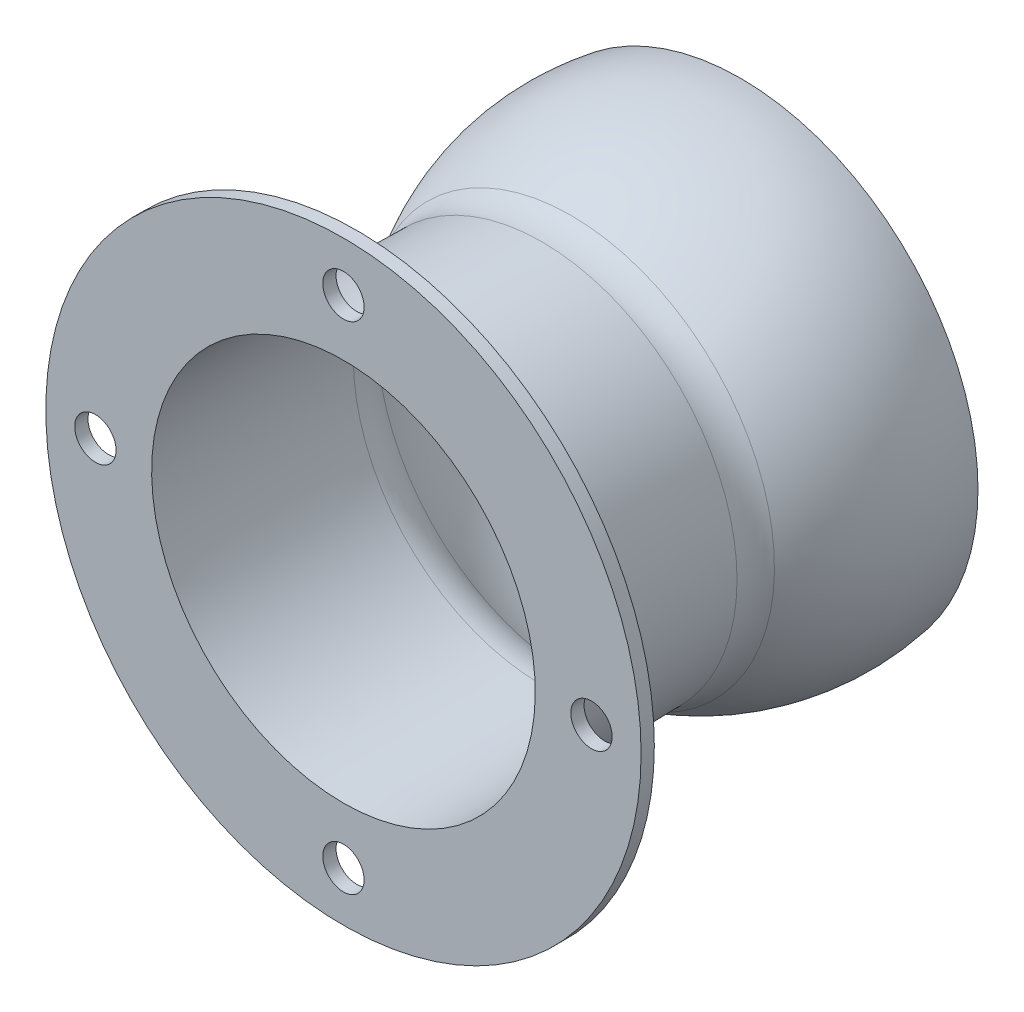
ISO-10303-21;
HEADER;
FILE_DESCRIPTION(('STEP AP214'),'2;1');
FILE_NAME('part.step','',(''),(''),'','','');
FILE_SCHEMA(('AUTOMOTIVE_DESIGN { 1 0 10303 214 1 1 1 1 }'));
ENDSEC;
DATA;
#1=APPLICATION_CONTEXT('core data for automotive mechanical design processes');
#2=APPLICATION_PROTOCOL_DEFINITION('international standard','automotive_design',2000,#1);
#3=PRODUCT_CONTEXT('',#1,'mechanical');
#4=PRODUCT('Part','Part','',(#3));
#5=PRODUCT_RELATED_PRODUCT_CATEGORY('part','',(#4));
#6=PRODUCT_DEFINITION_FORMATION('','',#4);
#7=PRODUCT_DEFINITION_CONTEXT('part definition',#1,'design');
#8=PRODUCT_DEFINITION('design','',#6,#7);
#9=PRODUCT_DEFINITION_SHAPE('','',#8);
#10=(LENGTH_UNIT() NAMED_UNIT(*) SI_UNIT(.MILLI.,.METRE.));
#11=(NAMED_UNIT(*) PLANE_ANGLE_UNIT() SI_UNIT($,.RADIAN.));
#12=(NAMED_UNIT(*) SI_UNIT($,.STERADIAN.) SOLID_ANGLE_UNIT());
#13=UNCERTAINTY_MEASURE_WITH_UNIT(LENGTH_MEASURE(1.E-05),#10,'distance_accuracy_value','');
#14=(GEOMETRIC_REPRESENTATION_CONTEXT(3) GLOBAL_UNCERTAINTY_ASSIGNED_CONTEXT((#13)) GLOBAL_UNIT_ASSIGNED_CONTEXT((#10,
#11,#12)) REPRESENTATION_CONTEXT('',''));
#15=CARTESIAN_POINT('',(0.,0.,0.));
#16=DIRECTION('',(0.,0.,1.));
#17=DIRECTION('',(1.,0.,0.));
#18=AXIS2_PLACEMENT_3D('',#15,#16,#17);
#19=CARTESIAN_POINT('',(0.,0.,30.0542550144842));
#20=DIRECTION('',(0.,0.,1.));
#21=DIRECTION('',(0.,-1.,0.));
#22=AXIS2_PLACEMENT_3D('',#19,#20,#21);
#23=CONICAL_SURFACE('',#22,29.5,0.0166651237139406);
#24=CARTESIAN_POINT('',(0.,0.,30.0542550144842));
#25=DIRECTION('',(0.,0.,-1.));
#26=DIRECTION('',(0.,1.,0.));
#27=AXIS2_PLACEMENT_3D('',#24,#25,#26);
#28=CIRCLE('',#27,29.5);
#29=CARTESIAN_POINT('',(0.,29.5,30.0542550144842));
#30=VERTEX_POINT('',#29);
#31=EDGE_CURVE('E45',#30,#30,#28,.T.);
#32=ORIENTED_EDGE('',*,*,#31,.F.);
#33=EDGE_LOOP('',(#32));
#34=FACE_BOUND('',#33,.T.);
#35=CARTESIAN_POINT('',(0.,0.,58.0542550144842));
#36=DIRECTION('',(0.,0.,1.));
#37=DIRECTION('',(1.,0.,0.));
#38=AXIS2_PLACEMENT_3D('',#35,#36,#37);
#39=CIRCLE('',#38,29.9666666666667);
#40=CARTESIAN_POINT('',(29.9666666666667,0.,58.0542550144842));
#41=VERTEX_POINT('',#40);
#42=EDGE_CURVE('E41',#41,#41,#39,.F.);
#43=ORIENTED_EDGE('',*,*,#42,.T.);
#44=EDGE_LOOP('',(#43));
#45=FACE_BOUND('',#44,.T.);
#46=ADVANCED_FACE('F37',(#34,#45),#23,.T.);
#47=CARTESIAN_POINT('',(0.,0.,6.14714548940946));
#48=DIRECTION('',(0.,0.,-1.));
#49=DIRECTION('',(0.,1.,0.));
#50=AXIS2_PLACEMENT_3D('',#47,#48,#49);
#51=SPHERICAL_SURFACE('',#50,36.4);
#52=CARTESIAN_POINT('',(0.,0.,25.637373582046));
#53=DIRECTION('',(0.,0.,-1.));
#54=DIRECTION('',(0.,1.,0.));
#55=AXIS2_PLACEMENT_3D('',#52,#53,#54);
#56=CIRCLE('',#55,30.7423325220615);
#57=CARTESIAN_POINT('',(0.,30.7423325220615,25.637373582046));
#58=VERTEX_POINT('',#57);
#59=EDGE_CURVE('E10',#58,#58,#56,.T.);
#60=ORIENTED_EDGE('',*,*,#59,.T.);
#61=EDGE_LOOP('',(#60));
#62=FACE_BOUND('',#61,.T.);
#63=CARTESIAN_POINT('',(0.,0.,0.));
#64=DIRECTION('',(0.,0.,-1.));
#65=DIRECTION('',(0.,1.,0.));
#66=AXIS2_PLACEMENT_3D('',#63,#64,#65);
#67=CIRCLE('',#66,35.8771877706717);
#68=CARTESIAN_POINT('',(0.,35.8771877706717,0.));
#69=VERTEX_POINT('',#68);
#70=EDGE_CURVE('E49',#69,#69,#67,.T.);
#71=ORIENTED_EDGE('',*,*,#70,.F.);
#72=EDGE_LOOP('',(#71));
#73=FACE_BOUND('',#72,.T.);
#74=ADVANCED_FACE('F39',(#62,#73),#51,.T.);
#75=CARTESIAN_POINT('',(0.,0.,29.9209401958123));
#76=DIRECTION('',(0.,0.,-1.));
#77=DIRECTION('',(0.,1.,0.));
#78=AXIS2_PLACEMENT_3D('',#75,#76,#77);
#79=TOROIDAL_SURFACE('',#78,37.4988891203168,8.00000000000001);
#80=ORIENTED_EDGE('',*,*,#31,.T.);
#81=EDGE_LOOP('',(#80));
#82=FACE_BOUND('',#81,.T.);
#83=ORIENTED_EDGE('',*,*,#59,.F.);
#84=EDGE_LOOP('',(#83));
#85=FACE_BOUND('',#84,.T.);
#86=ADVANCED_FACE('F111',(#82,#85),#79,.F.);
#87=CARTESIAN_POINT('',(0.,0.,60.0542550144842));
#88=DIRECTION('',(0.,0.,1.));
#89=DIRECTION('',(0.,-1.,0.));
#90=AXIS2_PLACEMENT_3D('',#87,#88,#89);
#91=PLANE('',#90);
#92=CARTESIAN_POINT('',(0.,0.,60.0542550144842));
#93=DIRECTION('',(0.,0.,1.));
#94=DIRECTION('',(0.,-1.,0.));
#95=AXIS2_PLACEMENT_3D('',#92,#93,#94);
#96=CIRCLE('',#95,28.9998611207548);
#97=CARTESIAN_POINT('',(0.,-28.9998611207548,60.0542550144842));
#98=VERTEX_POINT('',#97);
#99=EDGE_CURVE('E55',#98,#98,#96,.F.);
#100=ORIENTED_EDGE('',*,*,#99,.T.);
#101=EDGE_LOOP('',(#100));
#102=FACE_BOUND('',#101,.T.);
#103=CARTESIAN_POINT('',(-37.5,0.,60.0542550144842));
#104=DIRECTION('',(0.,0.,1.));
#105=DIRECTION('',(1.,0.,0.));
#106=AXIS2_PLACEMENT_3D('',#103,#104,#105);
#107=CIRCLE('',#106,3.125);
#108=CARTESIAN_POINT('',(-34.375,0.,60.0542550144842));
#109=VERTEX_POINT('',#108);
#110=EDGE_CURVE('E91',#109,#109,#107,.T.);
#111=ORIENTED_EDGE('',*,*,#110,.F.);
#112=EDGE_LOOP('',(#111));
#113=FACE_BOUND('',#112,.T.);
#114=CARTESIAN_POINT('',(0.,-37.5,60.0542550144842));
#115=DIRECTION('',(0.,0.,1.));
#116=DIRECTION('',(1.,0.,0.));
#117=AXIS2_PLACEMENT_3D('',#114,#115,#116);
#118=CIRCLE('',#117,3.125);
#119=CARTESIAN_POINT('',(3.12500000000001,-37.5,60.0542550144842));
#120=VERTEX_POINT('',#119);
#121=EDGE_CURVE('E85',#120,#120,#118,.T.);
#122=ORIENTED_EDGE('',*,*,#121,.F.);
#123=EDGE_LOOP('',(#122));
#124=FACE_BOUND('',#123,.T.);
#125=CARTESIAN_POINT('',(37.5,0.,60.0542550144842));
#126=DIRECTION('',(0.,0.,1.));
#127=DIRECTION('',(1.,0.,0.));
#128=AXIS2_PLACEMENT_3D('',#125,#126,#127);
#129=CIRCLE('',#128,3.12500000000012);
#130=CARTESIAN_POINT('',(40.6250000000001,0.,60.0542550144842));
#131=VERTEX_POINT('',#130);
#132=EDGE_CURVE('E79',#131,#131,#129,.T.);
#133=ORIENTED_EDGE('',*,*,#132,.F.);
#134=EDGE_LOOP('',(#133));
#135=FACE_BOUND('',#134,.T.);
#136=CARTESIAN_POINT('',(0.,37.5,60.0542550144842));
#137=DIRECTION('',(0.,0.,1.));
#138=DIRECTION('',(1.,0.,0.));
#139=AXIS2_PLACEMENT_3D('',#136,#137,#138);
#140=CIRCLE('',#139,3.125);
#141=CARTESIAN_POINT('',(3.125,37.5,60.0542550144842));
#142=VERTEX_POINT('',#141);
#143=EDGE_CURVE('E73',#142,#142,#140,.T.);
#144=ORIENTED_EDGE('',*,*,#143,.F.);
#145=EDGE_LOOP('',(#144));
#146=FACE_BOUND('',#145,.T.);
#147=CARTESIAN_POINT('',(0.,0.,60.0542550144842));
#148=DIRECTION('',(0.,0.,1.));
#149=DIRECTION('',(1.,0.,0.));
#150=AXIS2_PLACEMENT_3D('',#147,#148,#149);
#151=CIRCLE('',#150,45.);
#152=CARTESIAN_POINT('',(45.,0.,60.0542550144842));
#153=VERTEX_POINT('',#152);
#154=EDGE_CURVE('E66',#153,#153,#151,.T.);
#155=ORIENTED_EDGE('',*,*,#154,.T.);
#156=EDGE_LOOP('',(#155));
#157=FACE_BOUND('',#156,.T.);
#158=ADVANCED_FACE('F107',(#102,#113,#124,#135,#146,#157),#91,.T.);
#159=CARTESIAN_POINT('',(0.,0.,0.));
#160=DIRECTION('',(0.,0.,1.));
#161=DIRECTION('',(0.,-1.,0.));
#162=AXIS2_PLACEMENT_3D('',#159,#160,#161);
#163=PLANE('',#162);
#164=CARTESIAN_POINT('',(0.,0.,0.));
#165=DIRECTION('',(0.,0.,1.));
#166=DIRECTION('',(0.,-1.,0.));
#167=AXIS2_PLACEMENT_3D('',#164,#165,#166);
#168=CIRCLE('',#167,34.8621944566321);
#169=CARTESIAN_POINT('',(0.,-34.8621944566321,0.));
#170=VERTEX_POINT('',#169);
#171=EDGE_CURVE('E59',#170,#170,#168,.F.);
#172=ORIENTED_EDGE('',*,*,#171,.F.);
#173=EDGE_LOOP('',(#172));
#174=FACE_BOUND('',#173,.T.);
#175=ORIENTED_EDGE('',*,*,#70,.T.);
#176=EDGE_LOOP('',(#175));
#177=FACE_BOUND('',#176,.T.);
#178=ADVANCED_FACE('F110',(#174,#177),#163,.F.);
#179=CARTESIAN_POINT('',(0.,0.,6.14714548940946));
#180=DIRECTION('',(0.,0.,-1.));
#181=DIRECTION('',(0.,1.,0.));
#182=AXIS2_PLACEMENT_3D('',#179,#180,#181);
#183=SPHERICAL_SURFACE('',#182,35.4);
#184=CARTESIAN_POINT('',(0.,0.,25.1019277553252));
#185=DIRECTION('',(0.,0.,-1.));
#186=DIRECTION('',(0.,1.,0.));
#187=AXIS2_PLACEMENT_3D('',#184,#185,#186);
#188=CIRCLE('',#187,29.8977629472796);
#189=CARTESIAN_POINT('',(0.,29.8977629472796,25.1019277553252));
#190=VERTEX_POINT('',#189);
#191=EDGE_CURVE('E54',#190,#190,#188,.T.);
#192=ORIENTED_EDGE('',*,*,#191,.F.);
#193=EDGE_LOOP('',(#192));
#194=FACE_BOUND('',#193,.T.);
#195=ORIENTED_EDGE('',*,*,#171,.T.);
#196=EDGE_LOOP('',(#195));
#197=FACE_BOUND('',#196,.T.);
#198=ADVANCED_FACE('F164',(#194,#197),#183,.F.);
#199=CARTESIAN_POINT('',(0.,0.,29.9209401958123));
#200=DIRECTION('',(0.,0.,-1.));
#201=DIRECTION('',(0.,1.,0.));
#202=AXIS2_PLACEMENT_3D('',#199,#200,#201);
#203=TOROIDAL_SURFACE('',#202,37.4988891203168,9.00000000000001);
#204=CARTESIAN_POINT('',(0.,0.,30.0709193668182));
#205=DIRECTION('',(0.,0.,-1.));
#206=DIRECTION('',(0.,1.,0.));
#207=AXIS2_PLACEMENT_3D('',#204,#205,#206);
#208=CIRCLE('',#207,28.5001388599604);
#209=CARTESIAN_POINT('',(0.,28.5001388599604,30.0709193668182));
#210=VERTEX_POINT('',#209);
#211=EDGE_CURVE('E58',#210,#210,#208,.T.);
#212=ORIENTED_EDGE('',*,*,#211,.F.);
#213=EDGE_LOOP('',(#212));
#214=FACE_BOUND('',#213,.T.);
#215=ORIENTED_EDGE('',*,*,#191,.T.);
#216=EDGE_LOOP('',(#215));
#217=FACE_BOUND('',#216,.T.);
#218=ADVANCED_FACE('F134',(#214,#217),#203,.T.);
#219=CARTESIAN_POINT('',(0.,0.,30.0709193668182));
#220=DIRECTION('',(0.,0.,1.));
#221=DIRECTION('',(0.,-1.,0.));
#222=AXIS2_PLACEMENT_3D('',#219,#220,#221);
#223=CONICAL_SURFACE('',#222,28.5001388599604,0.0166651237139406);
#224=ORIENTED_EDGE('',*,*,#99,.F.);
#225=EDGE_LOOP('',(#224));
#226=FACE_BOUND('',#225,.T.);
#227=ORIENTED_EDGE('',*,*,#211,.T.);
#228=EDGE_LOOP('',(#227));
#229=FACE_BOUND('',#228,.T.);
#230=ADVANCED_FACE('F124',(#226,#229),#223,.F.);
#231=CARTESIAN_POINT('',(0.,0.,58.0542550144842));
#232=DIRECTION('',(0.,0.,1.));
#233=DIRECTION('',(1.,0.,0.));
#234=AXIS2_PLACEMENT_3D('',#231,#232,#233);
#235=CYLINDRICAL_SURFACE('',#234,45.);
#236=CARTESIAN_POINT('',(0.,0.,58.0542550144842));
#237=DIRECTION('',(0.,0.,1.));
#238=DIRECTION('',(1.,0.,0.));
#239=AXIS2_PLACEMENT_3D('',#236,#237,#238);
#240=CIRCLE('',#239,45.);
#241=CARTESIAN_POINT('',(45.,0.,58.0542550144842));
#242=VERTEX_POINT('',#241);
#243=EDGE_CURVE('E69',#242,#242,#240,.T.);
#244=ORIENTED_EDGE('',*,*,#243,.T.);
#245=EDGE_LOOP('',(#244));
#246=FACE_BOUND('',#245,.T.);
#247=ORIENTED_EDGE('',*,*,#154,.F.);
#248=EDGE_LOOP('',(#247));
#249=FACE_BOUND('',#248,.T.);
#250=ADVANCED_FACE('F122',(#246,#249),#235,.T.);
#251=CARTESIAN_POINT('',(0.,0.,58.0542550144842));
#252=DIRECTION('',(0.,0.,1.));
#253=DIRECTION('',(1.,0.,0.));
#254=AXIS2_PLACEMENT_3D('',#251,#252,#253);
#255=PLANE('',#254);
#256=ORIENTED_EDGE('',*,*,#42,.F.);
#257=EDGE_LOOP('',(#256));
#258=FACE_BOUND('',#257,.T.);
#259=CARTESIAN_POINT('',(-37.5,0.,58.0542550144842));
#260=DIRECTION('',(0.,0.,1.));
#261=DIRECTION('',(1.,0.,0.));
#262=AXIS2_PLACEMENT_3D('',#259,#260,#261);
#263=CIRCLE('',#262,3.125);
#264=CARTESIAN_POINT('',(-34.375,0.,58.0542550144842));
#265=VERTEX_POINT('',#264);
#266=EDGE_CURVE('E88',#265,#265,#263,.T.);
#267=ORIENTED_EDGE('',*,*,#266,.T.);
#268=EDGE_LOOP('',(#267));
#269=FACE_BOUND('',#268,.T.);
#270=CARTESIAN_POINT('',(0.,-37.5,58.0542550144842));
#271=DIRECTION('',(0.,0.,1.));
#272=DIRECTION('',(1.,0.,0.));
#273=AXIS2_PLACEMENT_3D('',#270,#271,#272);
#274=CIRCLE('',#273,3.125);
#275=CARTESIAN_POINT('',(3.12500000000001,-37.5,58.0542550144842));
#276=VERTEX_POINT('',#275);
#277=EDGE_CURVE('E82',#276,#276,#274,.T.);
#278=ORIENTED_EDGE('',*,*,#277,.T.);
#279=EDGE_LOOP('',(#278));
#280=FACE_BOUND('',#279,.T.);
#281=CARTESIAN_POINT('',(37.5,0.,58.0542550144842));
#282=DIRECTION('',(0.,0.,1.));
#283=DIRECTION('',(1.,0.,0.));
#284=AXIS2_PLACEMENT_3D('',#281,#282,#283);
#285=CIRCLE('',#284,3.12500000000012);
#286=CARTESIAN_POINT('',(40.6250000000001,0.,58.0542550144842));
#287=VERTEX_POINT('',#286);
#288=EDGE_CURVE('E76',#287,#287,#285,.T.);
#289=ORIENTED_EDGE('',*,*,#288,.T.);
#290=EDGE_LOOP('',(#289));
#291=FACE_BOUND('',#290,.T.);
#292=CARTESIAN_POINT('',(0.,37.5,58.0542550144842));
#293=DIRECTION('',(0.,0.,1.));
#294=DIRECTION('',(1.,0.,0.));
#295=AXIS2_PLACEMENT_3D('',#292,#293,#294);
#296=CIRCLE('',#295,3.125);
#297=CARTESIAN_POINT('',(3.125,37.5,58.0542550144842));
#298=VERTEX_POINT('',#297);
#299=EDGE_CURVE('E70',#298,#298,#296,.T.);
#300=ORIENTED_EDGE('',*,*,#299,.T.);
#301=EDGE_LOOP('',(#300));
#302=FACE_BOUND('',#301,.T.);
#303=ORIENTED_EDGE('',*,*,#243,.F.);
#304=EDGE_LOOP('',(#303));
#305=FACE_BOUND('',#304,.T.);
#306=ADVANCED_FACE('F97',(#258,#269,#280,#291,#302,#305),#255,.F.);
#307=CARTESIAN_POINT('',(0.,37.5,58.0542550144842));
#308=DIRECTION('',(0.,0.,1.));
#309=DIRECTION('',(1.,0.,0.));
#310=AXIS2_PLACEMENT_3D('',#307,#308,#309);
#311=CYLINDRICAL_SURFACE('',#310,3.125);
#312=ORIENTED_EDGE('',*,*,#299,.F.);
#313=EDGE_LOOP('',(#312));
#314=FACE_BOUND('',#313,.T.);
#315=ORIENTED_EDGE('',*,*,#143,.T.);
#316=EDGE_LOOP('',(#315));
#317=FACE_BOUND('',#316,.T.);
#318=ADVANCED_FACE('F131',(#314,#317),#311,.F.);
#319=CARTESIAN_POINT('',(37.5,0.,58.0542550144842));
#320=DIRECTION('',(0.,0.,1.));
#321=DIRECTION('',(1.,0.,0.));
#322=AXIS2_PLACEMENT_3D('',#319,#320,#321);
#323=CYLINDRICAL_SURFACE('',#322,3.12500000000012);
#324=ORIENTED_EDGE('',*,*,#288,.F.);
#325=EDGE_LOOP('',(#324));
#326=FACE_BOUND('',#325,.T.);
#327=ORIENTED_EDGE('',*,*,#132,.T.);
#328=EDGE_LOOP('',(#327));
#329=FACE_BOUND('',#328,.T.);
#330=ADVANCED_FACE('F211',(#326,#329),#323,.F.);
#331=CARTESIAN_POINT('',(0.,-37.5,58.0542550144842));
#332=DIRECTION('',(0.,0.,1.));
#333=DIRECTION('',(1.,0.,0.));
#334=AXIS2_PLACEMENT_3D('',#331,#332,#333);
#335=CYLINDRICAL_SURFACE('',#334,3.125);
#336=ORIENTED_EDGE('',*,*,#277,.F.);
#337=EDGE_LOOP('',(#336));
#338=FACE_BOUND('',#337,.T.);
#339=ORIENTED_EDGE('',*,*,#121,.T.);
#340=EDGE_LOOP('',(#339));
#341=FACE_BOUND('',#340,.T.);
#342=ADVANCED_FACE('F103',(#338,#341),#335,.F.);
#343=CARTESIAN_POINT('',(-37.5,0.,58.0542550144842));
#344=DIRECTION('',(0.,0.,1.));
#345=DIRECTION('',(1.,0.,0.));
#346=AXIS2_PLACEMENT_3D('',#343,#344,#345);
#347=CYLINDRICAL_SURFACE('',#346,3.125);
#348=ORIENTED_EDGE('',*,*,#266,.F.);
#349=EDGE_LOOP('',(#348));
#350=FACE_BOUND('',#349,.T.);
#351=ORIENTED_EDGE('',*,*,#110,.T.);
#352=EDGE_LOOP('',(#351));
#353=FACE_BOUND('',#352,.T.);
#354=ADVANCED_FACE('F100',(#350,#353),#347,.F.);
#355=CLOSED_SHELL('',(#46,#74,#86,#158,#178,#198,#218,#230,#250,#306,#318,#330,#342,#354));
#356=MANIFOLD_SOLID_BREP('B2',#355);
#357=ADVANCED_BREP_SHAPE_REPRESENTATION('',(#18,#356),#14);
#358=SHAPE_DEFINITION_REPRESENTATION(#9,#357);
ENDSEC;
END-ISO-10303-21;
